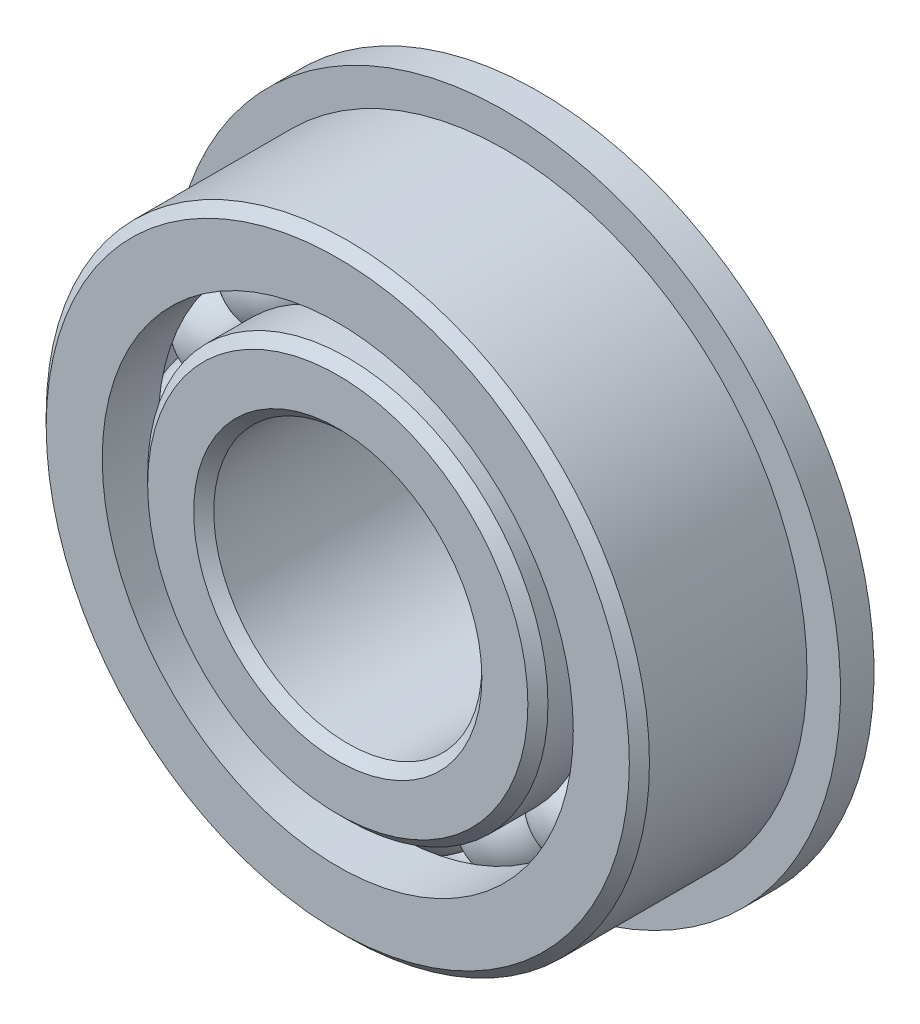
ISO-10303-21;
HEADER;
FILE_DESCRIPTION(('STEP AP214'),'2;1');
FILE_NAME('part.step','',(''),(''),'','','');
FILE_SCHEMA(('AUTOMOTIVE_DESIGN { 1 0 10303 214 1 1 1 1 }'));
ENDSEC;
DATA;
#1=APPLICATION_CONTEXT('core data for automotive mechanical design processes');
#2=APPLICATION_PROTOCOL_DEFINITION('international standard','automotive_design',2000,#1);
#3=PRODUCT_CONTEXT('',#1,'mechanical');
#4=PRODUCT('Part','Part','',(#3));
#5=PRODUCT_RELATED_PRODUCT_CATEGORY('part','',(#4));
#6=PRODUCT_DEFINITION_FORMATION('','',#4);
#7=PRODUCT_DEFINITION_CONTEXT('part definition',#1,'design');
#8=PRODUCT_DEFINITION('design','',#6,#7);
#9=PRODUCT_DEFINITION_SHAPE('','',#8);
#10=(LENGTH_UNIT() NAMED_UNIT(*) SI_UNIT(.MILLI.,.METRE.));
#11=(NAMED_UNIT(*) PLANE_ANGLE_UNIT() SI_UNIT($,.RADIAN.));
#12=(NAMED_UNIT(*) SI_UNIT($,.STERADIAN.) SOLID_ANGLE_UNIT());
#13=UNCERTAINTY_MEASURE_WITH_UNIT(LENGTH_MEASURE(1.E-05),#10,'distance_accuracy_value','');
#14=(GEOMETRIC_REPRESENTATION_CONTEXT(3) GLOBAL_UNCERTAINTY_ASSIGNED_CONTEXT((#13)) GLOBAL_UNIT_ASSIGNED_CONTEXT((#10,
#11,#12)) REPRESENTATION_CONTEXT('',''));
#15=CARTESIAN_POINT('',(0.,0.,0.));
#16=DIRECTION('',(0.,0.,1.));
#17=DIRECTION('',(1.,0.,0.));
#18=AXIS2_PLACEMENT_3D('',#15,#16,#17);
#19=CARTESIAN_POINT('',(-3.94881466771714,9.53328192610089,0.));
#20=DIRECTION('',(0.,0.,1.));
#21=DIRECTION('',(-0.382683432365077,0.923879532511292,0.));
#22=AXIS2_PLACEMENT_3D('',#19,#20,#21);
#23=SPHERICAL_SURFACE('',#22,2.27628073054021);
#24=CARTESIAN_POINT('',(-3.94881466771714,9.53328192610089,2.27628073054021));
#25=VERTEX_POINT('',#24);
#26=VERTEX_LOOP('',#25);
#27=FACE_BOUND('',#26,.T.);
#28=ADVANCED_FACE('F49',(#27),#23,.T.);
#29=CLOSED_SHELL('',(#28));
#30=MANIFOLD_SOLID_BREP('B2',#29);
#31=CARTESIAN_POINT('',(-7.2964580983686,7.29645809836878,0.));
#32=DIRECTION('',(0.,0.,1.));
#33=DIRECTION('',(-0.707106781186539,0.707106781186556,0.));
#34=AXIS2_PLACEMENT_3D('',#31,#32,#33);
#35=SPHERICAL_SURFACE('',#34,2.27628073054021);
#36=CARTESIAN_POINT('',(-7.2964580983686,7.29645809836878,2.27628073054021));
#37=VERTEX_POINT('',#36);
#38=VERTEX_LOOP('',#37);
#39=FACE_BOUND('',#38,.T.);
#40=ADVANCED_FACE('F74',(#39),#35,.T.);
#41=CLOSED_SHELL('',(#40));
#42=MANIFOLD_SOLID_BREP('B7',#41);
#43=CARTESIAN_POINT('',(-9.5332819261008,3.94881466771737,0.));
#44=DIRECTION('',(0.,0.,1.));
#45=DIRECTION('',(-0.923879532511283,0.3826834323651,0.));
#46=AXIS2_PLACEMENT_3D('',#43,#44,#45);
#47=SPHERICAL_SURFACE('',#46,2.27628073054021);
#48=CARTESIAN_POINT('',(-9.5332819261008,3.94881466771737,2.27628073054021));
#49=VERTEX_POINT('',#48);
#50=VERTEX_LOOP('',#49);
#51=FACE_BOUND('',#50,.T.);
#52=ADVANCED_FACE('F99',(#51),#47,.T.);
#53=CLOSED_SHELL('',(#52));
#54=MANIFOLD_SOLID_BREP('B45',#53);
#55=CARTESIAN_POINT('',(-10.31875,1.08083169195563E-13,0.));
#56=DIRECTION('',(0.,0.,1.));
#57=DIRECTION('',(-1.,0.,0.));
#58=AXIS2_PLACEMENT_3D('',#55,#56,#57);
#59=SPHERICAL_SURFACE('',#58,2.27628073054021);
#60=CARTESIAN_POINT('',(-10.31875,1.08083169195563E-13,2.27628073054021));
#61=VERTEX_POINT('',#60);
#62=VERTEX_LOOP('',#61);
#63=FACE_BOUND('',#62,.T.);
#64=ADVANCED_FACE('F123',(#63),#59,.T.);
#65=CLOSED_SHELL('',(#64));
#66=MANIFOLD_SOLID_BREP('B70',#65);
#67=CARTESIAN_POINT('',(-9.53328192610088,-3.94881466771717,0.));
#68=DIRECTION('',(0.,0.,1.));
#69=DIRECTION('',(-0.923879532511291,-0.382683432365081,0.));
#70=AXIS2_PLACEMENT_3D('',#67,#68,#69);
#71=SPHERICAL_SURFACE('',#70,2.27628073054021);
#72=CARTESIAN_POINT('',(-9.53328192610088,-3.94881466771717,2.27628073054021));
#73=VERTEX_POINT('',#72);
#74=VERTEX_LOOP('',#73);
#75=FACE_BOUND('',#74,.T.);
#76=ADVANCED_FACE('F144',(#75),#71,.T.);
#77=CLOSED_SHELL('',(#76));
#78=MANIFOLD_SOLID_BREP('B95',#77);
#79=CARTESIAN_POINT('',(-7.29645809836875,-7.29645809836862,0.));
#80=DIRECTION('',(0.,0.,1.));
#81=DIRECTION('',(-0.707106781186554,-0.707106781186541,0.));
#82=AXIS2_PLACEMENT_3D('',#79,#80,#81);
#83=SPHERICAL_SURFACE('',#82,2.27628073054021);
#84=CARTESIAN_POINT('',(-7.29645809836875,-7.29645809836862,2.27628073054021));
#85=VERTEX_POINT('',#84);
#86=VERTEX_LOOP('',#85);
#87=FACE_BOUND('',#86,.T.);
#88=ADVANCED_FACE('F166',(#87),#83,.T.);
#89=CLOSED_SHELL('',(#88));
#90=MANIFOLD_SOLID_BREP('B119',#89);
#91=CARTESIAN_POINT('',(-3.94881466771735,-9.53328192610081,0.));
#92=DIRECTION('',(0.,0.,1.));
#93=DIRECTION('',(-0.382683432365097,-0.923879532511284,0.));
#94=AXIS2_PLACEMENT_3D('',#91,#92,#93);
#95=SPHERICAL_SURFACE('',#94,2.27628073054021);
#96=CARTESIAN_POINT('',(-3.94881466771735,-9.53328192610081,2.27628073054021));
#97=VERTEX_POINT('',#96);
#98=VERTEX_LOOP('',#97);
#99=FACE_BOUND('',#98,.T.);
#100=ADVANCED_FACE('F190',(#99),#95,.T.);
#101=CLOSED_SHELL('',(#100));
#102=MANIFOLD_SOLID_BREP('B140',#101);
#103=CARTESIAN_POINT('',(0.,-10.31875,0.));
#104=DIRECTION('',(0.,0.,1.));
#105=DIRECTION('',(0.,-1.,0.));
#106=AXIS2_PLACEMENT_3D('',#103,#104,#105);
#107=SPHERICAL_SURFACE('',#106,2.27628073054021);
#108=CARTESIAN_POINT('',(0.,-10.31875,2.27628073054021));
#109=VERTEX_POINT('',#108);
#110=VERTEX_LOOP('',#109);
#111=FACE_BOUND('',#110,.T.);
#112=ADVANCED_FACE('F212',(#111),#107,.T.);
#113=CLOSED_SHELL('',(#112));
#114=MANIFOLD_SOLID_BREP('B162',#113);
#115=CARTESIAN_POINT('',(3.94881466771721,-9.53328192610086,0.));
#116=DIRECTION('',(0.,0.,1.));
#117=DIRECTION('',(0.382683432365084,-0.923879532511289,0.));
#118=AXIS2_PLACEMENT_3D('',#115,#116,#117);
#119=SPHERICAL_SURFACE('',#118,2.27628073054021);
#120=CARTESIAN_POINT('',(3.94881466771721,-9.53328192610086,2.27628073054021));
#121=VERTEX_POINT('',#120);
#122=VERTEX_LOOP('',#121);
#123=FACE_BOUND('',#122,.T.);
#124=ADVANCED_FACE('F237',(#123),#119,.T.);
#125=CLOSED_SHELL('',(#124));
#126=MANIFOLD_SOLID_BREP('B186',#125);
#127=CARTESIAN_POINT('',(7.29645809836865,-7.29645809836873,0.));
#128=DIRECTION('',(0.,0.,1.));
#129=DIRECTION('',(0.707106781186544,-0.707106781186551,0.));
#130=AXIS2_PLACEMENT_3D('',#127,#128,#129);
#131=SPHERICAL_SURFACE('',#130,2.27628073054021);
#132=CARTESIAN_POINT('',(7.29645809836865,-7.29645809836873,2.27628073054021));
#133=VERTEX_POINT('',#132);
#134=VERTEX_LOOP('',#133);
#135=FACE_BOUND('',#134,.T.);
#136=ADVANCED_FACE('F261',(#135),#131,.T.);
#137=CLOSED_SHELL('',(#136));
#138=MANIFOLD_SOLID_BREP('B208',#137);
#139=CARTESIAN_POINT('',(9.53328192610082,-3.94881466771731,0.));
#140=DIRECTION('',(0.,0.,1.));
#141=DIRECTION('',(0.923879532511285,-0.382683432365094,0.));
#142=AXIS2_PLACEMENT_3D('',#139,#140,#141);
#143=SPHERICAL_SURFACE('',#142,2.27628073054021);
#144=CARTESIAN_POINT('',(9.53328192610082,-3.94881466771731,2.27628073054021));
#145=VERTEX_POINT('',#144);
#146=VERTEX_LOOP('',#145);
#147=FACE_BOUND('',#146,.T.);
#148=ADVANCED_FACE('F282',(#147),#143,.T.);
#149=CLOSED_SHELL('',(#148));
#150=MANIFOLD_SOLID_BREP('B233',#149);
#151=CARTESIAN_POINT('',(10.31875,0.,0.));
#152=DIRECTION('',(0.,0.,1.));
#153=DIRECTION('',(1.,0.,0.));
#154=AXIS2_PLACEMENT_3D('',#151,#152,#153);
#155=SPHERICAL_SURFACE('',#154,2.27628073054021);
#156=CARTESIAN_POINT('',(10.31875,0.,2.27628073054021));
#157=VERTEX_POINT('',#156);
#158=VERTEX_LOOP('',#157);
#159=FACE_BOUND('',#158,.T.);
#160=ADVANCED_FACE('F303',(#159),#155,.T.);
#161=CLOSED_SHELL('',(#160));
#162=MANIFOLD_SOLID_BREP('B257',#161);
#163=CARTESIAN_POINT('',(9.53328192610085,3.94881466771724,0.));
#164=DIRECTION('',(0.,0.,1.));
#165=DIRECTION('',(0.923879532511288,0.382683432365087,0.));
#166=AXIS2_PLACEMENT_3D('',#163,#164,#165);
#167=SPHERICAL_SURFACE('',#166,2.27628073054021);
#168=CARTESIAN_POINT('',(9.53328192610085,3.94881466771724,2.27628073054021));
#169=VERTEX_POINT('',#168);
#170=VERTEX_LOOP('',#169);
#171=FACE_BOUND('',#170,.T.);
#172=ADVANCED_FACE('F324',(#171),#167,.T.);
#173=CLOSED_SHELL('',(#172));
#174=MANIFOLD_SOLID_BREP('B278',#173);
#175=CARTESIAN_POINT('',(7.2964580983687,7.29645809836867,0.));
#176=DIRECTION('',(0.,0.,1.));
#177=DIRECTION('',(0.707106781186549,0.707106781186546,0.));
#178=AXIS2_PLACEMENT_3D('',#175,#176,#177);
#179=SPHERICAL_SURFACE('',#178,2.27628073054021);
#180=CARTESIAN_POINT('',(7.2964580983687,7.29645809836867,2.27628073054021));
#181=VERTEX_POINT('',#180);
#182=VERTEX_LOOP('',#181);
#183=FACE_BOUND('',#182,.T.);
#184=ADVANCED_FACE('F345',(#183),#179,.T.);
#185=CLOSED_SHELL('',(#184));
#186=MANIFOLD_SOLID_BREP('B299',#185);
#187=CARTESIAN_POINT('',(3.94881466771728,9.53328192610084,0.));
#188=DIRECTION('',(0.,0.,1.));
#189=DIRECTION('',(0.382683432365091,0.923879532511287,0.));
#190=AXIS2_PLACEMENT_3D('',#187,#188,#189);
#191=SPHERICAL_SURFACE('',#190,2.27628073054021);
#192=CARTESIAN_POINT('',(3.94881466771728,9.53328192610084,2.27628073054021));
#193=VERTEX_POINT('',#192);
#194=VERTEX_LOOP('',#193);
#195=FACE_BOUND('',#194,.T.);
#196=ADVANCED_FACE('F366',(#195),#191,.T.);
#197=CLOSED_SHELL('',(#196));
#198=MANIFOLD_SOLID_BREP('B320',#197);
#199=CARTESIAN_POINT('',(0.,10.31875,0.));
#200=DIRECTION('',(0.,0.,1.));
#201=DIRECTION('',(0.,1.,0.));
#202=AXIS2_PLACEMENT_3D('',#199,#200,#201);
#203=SPHERICAL_SURFACE('',#202,2.27628073054021);
#204=CARTESIAN_POINT('',(0.,10.31875,2.27628073054021));
#205=VERTEX_POINT('',#204);
#206=VERTEX_LOOP('',#205);
#207=FACE_BOUND('',#206,.T.);
#208=ADVANCED_FACE('F391',(#207),#203,.T.);
#209=CLOSED_SHELL('',(#208));
#210=MANIFOLD_SOLID_BREP('B341',#209);
#211=CARTESIAN_POINT('',(0.,0.,4.28625));
#212=DIRECTION('',(0.,0.,-1.));
#213=DIRECTION('',(-1.,0.,0.));
#214=AXIS2_PLACEMENT_3D('',#211,#212,#213);
#215=CONICAL_SURFACE('',#214,9.48138736263737,0.785398163397445);
#216=CARTESIAN_POINT('',(0.,0.,4.7625));
#217=DIRECTION('',(0.,0.,1.));
#218=DIRECTION('',(1.,0.,0.));
#219=AXIS2_PLACEMENT_3D('',#216,#217,#218);
#220=CIRCLE('',#219,9.00513736263737);
#221=CARTESIAN_POINT('',(9.00513736263737,0.,4.7625));
#222=VERTEX_POINT('',#221);
#223=EDGE_CURVE('E453',#222,#222,#220,.T.);
#224=ORIENTED_EDGE('',*,*,#223,.F.);
#225=EDGE_LOOP('',(#224));
#226=FACE_BOUND('',#225,.T.);
#227=CARTESIAN_POINT('',(0.,0.,4.28625));
#228=DIRECTION('',(0.,0.,1.));
#229=DIRECTION('',(1.,0.,0.));
#230=AXIS2_PLACEMENT_3D('',#227,#228,#229);
#231=CIRCLE('',#230,9.48138736263737);
#232=CARTESIAN_POINT('',(9.48138736263737,0.,4.28625));
#233=VERTEX_POINT('',#232);
#234=EDGE_CURVE('E390',#233,#233,#231,.T.);
#235=ORIENTED_EDGE('',*,*,#234,.T.);
#236=EDGE_LOOP('',(#235));
#237=FACE_BOUND('',#236,.T.);
#238=ADVANCED_FACE('F419',(#226,#237),#215,.T.);
#239=CARTESIAN_POINT('',(0.,0.,4.7625));
#240=DIRECTION('',(0.,0.,1.));
#241=DIRECTION('',(1.,0.,0.));
#242=AXIS2_PLACEMENT_3D('',#239,#240,#241);
#243=CYLINDRICAL_SURFACE('',#242,9.48138736263737);
#244=ORIENTED_EDGE('',*,*,#234,.F.);
#245=EDGE_LOOP('',(#244));
#246=FACE_BOUND('',#245,.T.);
#247=CARTESIAN_POINT('',(0.,0.,2.11666666666666));
#248=DIRECTION('',(0.,0.,1.));
#249=DIRECTION('',(1.,0.,0.));
#250=AXIS2_PLACEMENT_3D('',#247,#248,#249);
#251=CIRCLE('',#250,9.48138736263737);
#252=CARTESIAN_POINT('',(9.48138736263737,0.,2.11666666666666));
#253=VERTEX_POINT('',#252);
#254=EDGE_CURVE('E425',#253,#253,#251,.T.);
#255=ORIENTED_EDGE('',*,*,#254,.T.);
#256=EDGE_LOOP('',(#255));
#257=FACE_BOUND('',#256,.T.);
#258=ADVANCED_FACE('F460',(#246,#257),#243,.T.);
#259=CARTESIAN_POINT('',(0.,0.,0.));
#260=DIRECTION('',(0.,0.,1.));
#261=DIRECTION('',(1.,0.,0.));
#262=AXIS2_PLACEMENT_3D('',#259,#260,#261);
#263=TOROIDAL_SURFACE('',#262,10.31875,2.27628073054021);
#264=ORIENTED_EDGE('',*,*,#254,.F.);
#265=EDGE_LOOP('',(#264));
#266=FACE_BOUND('',#265,.T.);
#267=CARTESIAN_POINT('',(0.,0.,-2.11666666666667));
#268=DIRECTION('',(0.,0.,1.));
#269=DIRECTION('',(1.,0.,0.));
#270=AXIS2_PLACEMENT_3D('',#267,#268,#269);
#271=CIRCLE('',#270,9.48138736263737);
#272=CARTESIAN_POINT('',(9.48138736263737,0.,-2.11666666666667));
#273=VERTEX_POINT('',#272);
#274=EDGE_CURVE('E429',#273,#273,#271,.T.);
#275=ORIENTED_EDGE('',*,*,#274,.T.);
#276=EDGE_LOOP('',(#275));
#277=FACE_BOUND('',#276,.T.);
#278=ADVANCED_FACE('F464',(#266,#277),#263,.F.);
#279=CARTESIAN_POINT('',(0.,0.,4.7625));
#280=DIRECTION('',(0.,0.,1.));
#281=DIRECTION('',(1.,0.,0.));
#282=AXIS2_PLACEMENT_3D('',#279,#280,#281);
#283=CYLINDRICAL_SURFACE('',#282,9.48138736263737);
#284=ORIENTED_EDGE('',*,*,#274,.F.);
#285=EDGE_LOOP('',(#284));
#286=FACE_BOUND('',#285,.T.);
#287=CARTESIAN_POINT('',(0.,0.,-5.87374999999999));
#288=DIRECTION('',(0.,0.,1.));
#289=DIRECTION('',(1.,0.,0.));
#290=AXIS2_PLACEMENT_3D('',#287,#288,#289);
#291=CIRCLE('',#290,9.48138736263737);
#292=CARTESIAN_POINT('',(9.48138736263737,0.,-5.87374999999999));
#293=VERTEX_POINT('',#292);
#294=EDGE_CURVE('E433',#293,#293,#291,.T.);
#295=ORIENTED_EDGE('',*,*,#294,.T.);
#296=EDGE_LOOP('',(#295));
#297=FACE_BOUND('',#296,.T.);
#298=ADVANCED_FACE('F469',(#286,#297),#283,.T.);
#299=CARTESIAN_POINT('',(0.,0.,-6.35));
#300=DIRECTION('',(0.,0.,1.));
#301=DIRECTION('',(1.,0.,0.));
#302=AXIS2_PLACEMENT_3D('',#299,#300,#301);
#303=CONICAL_SURFACE('',#302,9.00513736263737,0.785398163397443);
#304=ORIENTED_EDGE('',*,*,#294,.F.);
#305=EDGE_LOOP('',(#304));
#306=FACE_BOUND('',#305,.T.);
#307=CARTESIAN_POINT('',(0.,0.,-6.35));
#308=DIRECTION('',(0.,0.,1.));
#309=DIRECTION('',(1.,0.,0.));
#310=AXIS2_PLACEMENT_3D('',#307,#308,#309);
#311=CIRCLE('',#310,9.00513736263737);
#312=CARTESIAN_POINT('',(9.00513736263737,0.,-6.35));
#313=VERTEX_POINT('',#312);
#314=EDGE_CURVE('E438',#313,#313,#311,.T.);
#315=ORIENTED_EDGE('',*,*,#314,.T.);
#316=EDGE_LOOP('',(#315));
#317=FACE_BOUND('',#316,.T.);
#318=ADVANCED_FACE('F475',(#306,#317),#303,.T.);
#319=CARTESIAN_POINT('',(0.,9.00513736263737,-6.34999999999999));
#320=DIRECTION('',(0.,0.,1.));
#321=DIRECTION('',(1.,0.,0.));
#322=AXIS2_PLACEMENT_3D('',#319,#320,#321);
#323=PLANE('',#322);
#324=ORIENTED_EDGE('',*,*,#314,.F.);
#325=EDGE_LOOP('',(#324));
#326=FACE_BOUND('',#325,.T.);
#327=CARTESIAN_POINT('',(0.,0.,-6.34999999999999));
#328=DIRECTION('',(0.,0.,1.));
#329=DIRECTION('',(1.,0.,0.));
#330=AXIS2_PLACEMENT_3D('',#327,#328,#329);
#331=CIRCLE('',#330,6.82625);
#332=CARTESIAN_POINT('',(6.82625,0.,-6.34999999999999));
#333=VERTEX_POINT('',#332);
#334=EDGE_CURVE('E441',#333,#333,#331,.T.);
#335=ORIENTED_EDGE('',*,*,#334,.T.);
#336=EDGE_LOOP('',(#335));
#337=FACE_BOUND('',#336,.T.);
#338=ADVANCED_FACE('F479',(#326,#337),#323,.F.);
#339=CARTESIAN_POINT('',(0.,0.,-5.87374999999999));
#340=DIRECTION('',(0.,0.,-1.));
#341=DIRECTION('',(-1.,0.,0.));
#342=AXIS2_PLACEMENT_3D('',#339,#340,#341);
#343=CONICAL_SURFACE('',#342,6.35,0.785398163397447);
#344=ORIENTED_EDGE('',*,*,#334,.F.);
#345=EDGE_LOOP('',(#344));
#346=FACE_BOUND('',#345,.T.);
#347=CARTESIAN_POINT('',(0.,0.,-5.87374999999999));
#348=DIRECTION('',(0.,0.,1.));
#349=DIRECTION('',(1.,0.,0.));
#350=AXIS2_PLACEMENT_3D('',#347,#348,#349);
#351=CIRCLE('',#350,6.35);
#352=CARTESIAN_POINT('',(6.35,0.,-5.87374999999999));
#353=VERTEX_POINT('',#352);
#354=EDGE_CURVE('E444',#353,#353,#351,.T.);
#355=ORIENTED_EDGE('',*,*,#354,.T.);
#356=EDGE_LOOP('',(#355));
#357=FACE_BOUND('',#356,.T.);
#358=ADVANCED_FACE('F483',(#346,#357),#343,.F.);
#359=CARTESIAN_POINT('',(0.,0.,4.7625));
#360=DIRECTION('',(0.,0.,1.));
#361=DIRECTION('',(1.,0.,0.));
#362=AXIS2_PLACEMENT_3D('',#359,#360,#361);
#363=CYLINDRICAL_SURFACE('',#362,6.35);
#364=ORIENTED_EDGE('',*,*,#354,.F.);
#365=EDGE_LOOP('',(#364));
#366=FACE_BOUND('',#365,.T.);
#367=CARTESIAN_POINT('',(0.,0.,4.28625000000001));
#368=DIRECTION('',(0.,0.,1.));
#369=DIRECTION('',(1.,0.,0.));
#370=AXIS2_PLACEMENT_3D('',#367,#368,#369);
#371=CIRCLE('',#370,6.35);
#372=CARTESIAN_POINT('',(6.35,0.,4.28625000000001));
#373=VERTEX_POINT('',#372);
#374=EDGE_CURVE('E447',#373,#373,#371,.T.);
#375=ORIENTED_EDGE('',*,*,#374,.T.);
#376=EDGE_LOOP('',(#375));
#377=FACE_BOUND('',#376,.T.);
#378=ADVANCED_FACE('F487',(#366,#377),#363,.F.);
#379=CARTESIAN_POINT('',(0.,0.,4.7625));
#380=DIRECTION('',(0.,0.,1.));
#381=DIRECTION('',(1.,0.,0.));
#382=AXIS2_PLACEMENT_3D('',#379,#380,#381);
#383=CONICAL_SURFACE('',#382,6.82625,0.785398163397451);
#384=ORIENTED_EDGE('',*,*,#374,.F.);
#385=EDGE_LOOP('',(#384));
#386=FACE_BOUND('',#385,.T.);
#387=CARTESIAN_POINT('',(0.,0.,4.7625));
#388=DIRECTION('',(0.,0.,1.));
#389=DIRECTION('',(1.,0.,0.));
#390=AXIS2_PLACEMENT_3D('',#387,#388,#389);
#391=CIRCLE('',#390,6.82625);
#392=CARTESIAN_POINT('',(6.82625,0.,4.7625));
#393=VERTEX_POINT('',#392);
#394=EDGE_CURVE('E450',#393,#393,#391,.T.);
#395=ORIENTED_EDGE('',*,*,#394,.T.);
#396=EDGE_LOOP('',(#395));
#397=FACE_BOUND('',#396,.T.);
#398=ADVANCED_FACE('F491',(#386,#397),#383,.F.);
#399=CARTESIAN_POINT('',(0.,6.82625,4.7625));
#400=DIRECTION('',(0.,0.,-1.));
#401=DIRECTION('',(-1.,0.,0.));
#402=AXIS2_PLACEMENT_3D('',#399,#400,#401);
#403=PLANE('',#402);
#404=ORIENTED_EDGE('',*,*,#394,.F.);
#405=EDGE_LOOP('',(#404));
#406=FACE_BOUND('',#405,.T.);
#407=ORIENTED_EDGE('',*,*,#223,.T.);
#408=EDGE_LOOP('',(#407));
#409=FACE_BOUND('',#408,.T.);
#410=ADVANCED_FACE('F457',(#406,#409),#403,.F.);
#411=CLOSED_SHELL('',(#238,#258,#278,#298,#318,#338,#358,#378,#398,#410));
#412=MANIFOLD_SOLID_BREP('B362',#411);
#413=CARTESIAN_POINT('',(0.,0.,4.28625));
#414=DIRECTION('',(0.,0.,-1.));
#415=DIRECTION('',(-1.,0.,0.));
#416=AXIS2_PLACEMENT_3D('',#413,#414,#415);
#417=CONICAL_SURFACE('',#416,14.2875,0.785398163397445);
#418=CARTESIAN_POINT('',(0.,0.,4.7625));
#419=DIRECTION('',(0.,0.,1.));
#420=DIRECTION('',(1.,0.,0.));
#421=AXIS2_PLACEMENT_3D('',#418,#419,#420);
#422=CIRCLE('',#421,13.81125);
#423=CARTESIAN_POINT('',(13.81125,0.,4.7625));
#424=VERTEX_POINT('',#423);
#425=EDGE_CURVE('E599',#424,#424,#422,.T.);
#426=ORIENTED_EDGE('',*,*,#425,.F.);
#427=EDGE_LOOP('',(#426));
#428=FACE_BOUND('',#427,.T.);
#429=CARTESIAN_POINT('',(0.,0.,4.28625));
#430=DIRECTION('',(0.,0.,1.));
#431=DIRECTION('',(1.,0.,0.));
#432=AXIS2_PLACEMENT_3D('',#429,#430,#431);
#433=CIRCLE('',#432,14.2875);
#434=CARTESIAN_POINT('',(14.2875,0.,4.28625));
#435=VERTEX_POINT('',#434);
#436=EDGE_CURVE('E418',#435,#435,#433,.T.);
#437=ORIENTED_EDGE('',*,*,#436,.T.);
#438=EDGE_LOOP('',(#437));
#439=FACE_BOUND('',#438,.T.);
#440=ADVANCED_FACE('F577',(#428,#439),#417,.T.);
#441=CARTESIAN_POINT('',(0.,0.,4.7625));
#442=DIRECTION('',(0.,0.,1.));
#443=DIRECTION('',(1.,0.,0.));
#444=AXIS2_PLACEMENT_3D('',#441,#442,#443);
#445=CYLINDRICAL_SURFACE('',#444,14.2875);
#446=CARTESIAN_POINT('',(0.,0.,-3.175));
#447=DIRECTION('',(0.,0.,1.));
#448=DIRECTION('',(1.,0.,0.));
#449=AXIS2_PLACEMENT_3D('',#446,#447,#448);
#450=CIRCLE('',#449,14.2875);
#451=CARTESIAN_POINT('',(14.2875,0.,-3.175));
#452=VERTEX_POINT('',#451);
#453=EDGE_CURVE('E602',#452,#452,#450,.T.);
#454=ORIENTED_EDGE('',*,*,#453,.T.);
#455=EDGE_LOOP('',(#454));
#456=FACE_BOUND('',#455,.T.);
#457=ORIENTED_EDGE('',*,*,#436,.F.);
#458=EDGE_LOOP('',(#457));
#459=FACE_BOUND('',#458,.T.);
#460=ADVANCED_FACE('F622',(#456,#459),#445,.T.);
#461=CARTESIAN_POINT('',(0.,13.81125,-4.7625));
#462=DIRECTION('',(0.,0.,1.));
#463=DIRECTION('',(1.,0.,0.));
#464=AXIS2_PLACEMENT_3D('',#461,#462,#463);
#465=PLANE('',#464);
#466=CARTESIAN_POINT('',(0.,0.,-4.7625));
#467=DIRECTION('',(0.,0.,1.));
#468=DIRECTION('',(1.,0.,0.));
#469=AXIS2_PLACEMENT_3D('',#466,#467,#468);
#470=CIRCLE('',#469,11.1561126373626);
#471=CARTESIAN_POINT('',(11.1561126373626,0.,-4.7625));
#472=VERTEX_POINT('',#471);
#473=EDGE_CURVE('E583',#472,#472,#470,.T.);
#474=ORIENTED_EDGE('',*,*,#473,.T.);
#475=EDGE_LOOP('',(#474));
#476=FACE_BOUND('',#475,.T.);
#477=CARTESIAN_POINT('',(0.,0.,-4.7625));
#478=DIRECTION('',(0.,0.,-1.));
#479=DIRECTION('',(-1.,0.,0.));
#480=AXIS2_PLACEMENT_3D('',#477,#478,#479);
#481=CIRCLE('',#480,15.875);
#482=CARTESIAN_POINT('',(-15.875,0.,-4.7625));
#483=VERTEX_POINT('',#482);
#484=EDGE_CURVE('E605',#483,#483,#481,.T.);
#485=ORIENTED_EDGE('',*,*,#484,.T.);
#486=EDGE_LOOP('',(#485));
#487=FACE_BOUND('',#486,.T.);
#488=ADVANCED_FACE('F625',(#476,#487),#465,.F.);
#489=CARTESIAN_POINT('',(0.,0.,4.7625));
#490=DIRECTION('',(0.,0.,1.));
#491=DIRECTION('',(1.,0.,0.));
#492=AXIS2_PLACEMENT_3D('',#489,#490,#491);
#493=CYLINDRICAL_SURFACE('',#492,11.1561126373626);
#494=CARTESIAN_POINT('',(0.,0.,-2.11666666666667));
#495=DIRECTION('',(0.,0.,1.));
#496=DIRECTION('',(1.,0.,0.));
#497=AXIS2_PLACEMENT_3D('',#494,#495,#496);
#498=CIRCLE('',#497,11.1561126373626);
#499=CARTESIAN_POINT('',(11.1561126373626,0.,-2.11666666666667));
#500=VERTEX_POINT('',#499);
#501=EDGE_CURVE('E587',#500,#500,#498,.T.);
#502=ORIENTED_EDGE('',*,*,#501,.T.);
#503=EDGE_LOOP('',(#502));
#504=FACE_BOUND('',#503,.T.);
#505=ORIENTED_EDGE('',*,*,#473,.F.);
#506=EDGE_LOOP('',(#505));
#507=FACE_BOUND('',#506,.T.);
#508=ADVANCED_FACE('F630',(#504,#507),#493,.F.);
#509=CARTESIAN_POINT('',(0.,0.,0.));
#510=DIRECTION('',(0.,0.,1.));
#511=DIRECTION('',(1.,0.,0.));
#512=AXIS2_PLACEMENT_3D('',#509,#510,#511);
#513=TOROIDAL_SURFACE('',#512,10.31875,2.27628073054021);
#514=ORIENTED_EDGE('',*,*,#501,.F.);
#515=EDGE_LOOP('',(#514));
#516=FACE_BOUND('',#515,.T.);
#517=CARTESIAN_POINT('',(0.,0.,2.11666666666667));
#518=DIRECTION('',(0.,0.,1.));
#519=DIRECTION('',(1.,0.,0.));
#520=AXIS2_PLACEMENT_3D('',#517,#518,#519);
#521=CIRCLE('',#520,11.1561126373626);
#522=CARTESIAN_POINT('',(11.1561126373626,0.,2.11666666666667));
#523=VERTEX_POINT('',#522);
#524=EDGE_CURVE('E591',#523,#523,#521,.T.);
#525=ORIENTED_EDGE('',*,*,#524,.T.);
#526=EDGE_LOOP('',(#525));
#527=FACE_BOUND('',#526,.T.);
#528=ADVANCED_FACE('F636',(#516,#527),#513,.F.);
#529=CARTESIAN_POINT('',(0.,0.,4.7625));
#530=DIRECTION('',(0.,0.,1.));
#531=DIRECTION('',(1.,0.,0.));
#532=AXIS2_PLACEMENT_3D('',#529,#530,#531);
#533=CYLINDRICAL_SURFACE('',#532,11.1561126373626);
#534=ORIENTED_EDGE('',*,*,#524,.F.);
#535=EDGE_LOOP('',(#534));
#536=FACE_BOUND('',#535,.T.);
#537=CARTESIAN_POINT('',(0.,0.,4.7625));
#538=DIRECTION('',(0.,0.,1.));
#539=DIRECTION('',(1.,0.,0.));
#540=AXIS2_PLACEMENT_3D('',#537,#538,#539);
#541=CIRCLE('',#540,11.1561126373626);
#542=CARTESIAN_POINT('',(11.1561126373626,0.,4.7625));
#543=VERTEX_POINT('',#542);
#544=EDGE_CURVE('E596',#543,#543,#541,.T.);
#545=ORIENTED_EDGE('',*,*,#544,.T.);
#546=EDGE_LOOP('',(#545));
#547=FACE_BOUND('',#546,.T.);
#548=ADVANCED_FACE('F640',(#536,#547),#533,.F.);
#549=CARTESIAN_POINT('',(0.,13.81125,4.7625));
#550=DIRECTION('',(0.,0.,-1.));
#551=DIRECTION('',(-1.,0.,0.));
#552=AXIS2_PLACEMENT_3D('',#549,#550,#551);
#553=PLANE('',#552);
#554=ORIENTED_EDGE('',*,*,#544,.F.);
#555=EDGE_LOOP('',(#554));
#556=FACE_BOUND('',#555,.T.);
#557=ORIENTED_EDGE('',*,*,#425,.T.);
#558=EDGE_LOOP('',(#557));
#559=FACE_BOUND('',#558,.T.);
#560=ADVANCED_FACE('F618',(#556,#559),#553,.F.);
#561=CARTESIAN_POINT('',(0.,11.1561126373626,-3.175));
#562=DIRECTION('',(0.,0.,1.));
#563=DIRECTION('',(1.,0.,0.));
#564=AXIS2_PLACEMENT_3D('',#561,#562,#563);
#565=PLANE('',#564);
#566=CARTESIAN_POINT('',(0.,0.,-3.175));
#567=DIRECTION('',(0.,0.,-1.));
#568=DIRECTION('',(-1.,0.,0.));
#569=AXIS2_PLACEMENT_3D('',#566,#567,#568);
#570=CIRCLE('',#569,15.875);
#571=CARTESIAN_POINT('',(-15.875,0.,-3.175));
#572=VERTEX_POINT('',#571);
#573=EDGE_CURVE('E608',#572,#572,#570,.T.);
#574=ORIENTED_EDGE('',*,*,#573,.F.);
#575=EDGE_LOOP('',(#574));
#576=FACE_BOUND('',#575,.T.);
#577=ORIENTED_EDGE('',*,*,#453,.F.);
#578=EDGE_LOOP('',(#577));
#579=FACE_BOUND('',#578,.T.);
#580=ADVANCED_FACE('F615',(#576,#579),#565,.T.);
#581=CARTESIAN_POINT('',(0.,0.,-4.7625));
#582=DIRECTION('',(0.,0.,-1.));
#583=DIRECTION('',(-1.,0.,0.));
#584=AXIS2_PLACEMENT_3D('',#581,#582,#583);
#585=CYLINDRICAL_SURFACE('',#584,15.875);
#586=ORIENTED_EDGE('',*,*,#573,.T.);
#587=EDGE_LOOP('',(#586));
#588=FACE_BOUND('',#587,.T.);
#589=ORIENTED_EDGE('',*,*,#484,.F.);
#590=EDGE_LOOP('',(#589));
#591=FACE_BOUND('',#590,.T.);
#592=ADVANCED_FACE('F612',(#588,#591),#585,.T.);
#593=CLOSED_SHELL('',(#440,#460,#488,#508,#528,#548,#560,#580,#592));
#594=MANIFOLD_SOLID_BREP('B385',#593);
#595=ADVANCED_BREP_SHAPE_REPRESENTATION('',(#18,#30,#42,#54,#66,#78,#90,#102,#114,#126,#138,
#150,#162,#174,#186,#198,#210,#412,#594),#14);
#596=SHAPE_DEFINITION_REPRESENTATION(#9,#595);
ENDSEC;
END-ISO-10303-21;
